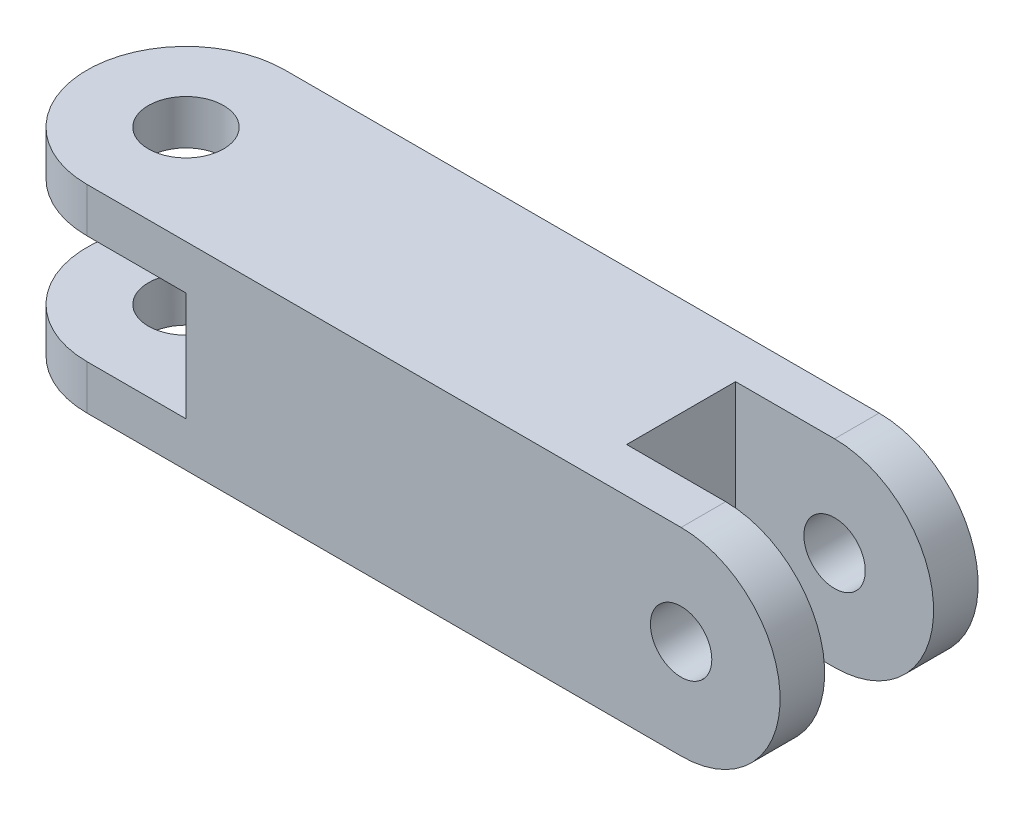
ISO-10303-21;
HEADER;
FILE_DESCRIPTION(('STEP AP214'),'2;1');
FILE_NAME('part.step','',(''),(''),'','','');
FILE_SCHEMA(('AUTOMOTIVE_DESIGN { 1 0 10303 214 1 1 1 1 }'));
ENDSEC;
DATA;
#1=APPLICATION_CONTEXT('core data for automotive mechanical design processes');
#2=APPLICATION_PROTOCOL_DEFINITION('international standard','automotive_design',2000,#1);
#3=PRODUCT_CONTEXT('',#1,'mechanical');
#4=PRODUCT('Part','Part','',(#3));
#5=PRODUCT_RELATED_PRODUCT_CATEGORY('part','',(#4));
#6=PRODUCT_DEFINITION_FORMATION('','',#4);
#7=PRODUCT_DEFINITION_CONTEXT('part definition',#1,'design');
#8=PRODUCT_DEFINITION('design','',#6,#7);
#9=PRODUCT_DEFINITION_SHAPE('','',#8);
#10=(LENGTH_UNIT() NAMED_UNIT(*) SI_UNIT(.MILLI.,.METRE.));
#11=(NAMED_UNIT(*) PLANE_ANGLE_UNIT() SI_UNIT($,.RADIAN.));
#12=(NAMED_UNIT(*) SI_UNIT($,.STERADIAN.) SOLID_ANGLE_UNIT());
#13=UNCERTAINTY_MEASURE_WITH_UNIT(LENGTH_MEASURE(1.E-05),#10,'distance_accuracy_value','');
#14=(GEOMETRIC_REPRESENTATION_CONTEXT(3) GLOBAL_UNCERTAINTY_ASSIGNED_CONTEXT((#13)) GLOBAL_UNIT_ASSIGNED_CONTEXT((#10,
#11,#12)) REPRESENTATION_CONTEXT('',''));
#15=CARTESIAN_POINT('',(0.,0.,0.));
#16=DIRECTION('',(0.,0.,1.));
#17=DIRECTION('',(1.,0.,0.));
#18=AXIS2_PLACEMENT_3D('',#15,#16,#17);
#19=CARTESIAN_POINT('',(-24.0583941605839,-9.11131386861314,5.));
#20=DIRECTION('',(0.,1.,0.));
#21=DIRECTION('',(0.,0.,1.));
#22=AXIS2_PLACEMENT_3D('',#19,#20,#21);
#23=CYLINDRICAL_SURFACE('',#22,1.9);
#24=CARTESIAN_POINT('',(-24.0583941605839,4.13868613138686,5.));
#25=DIRECTION('',(0.,1.,0.));
#26=DIRECTION('',(0.,0.,1.));
#27=AXIS2_PLACEMENT_3D('',#24,#25,#26);
#28=CIRCLE('',#27,1.9);
#29=CARTESIAN_POINT('',(-24.0583941605839,4.13868613138686,6.9));
#30=VERTEX_POINT('',#29);
#31=EDGE_CURVE('E247',#30,#30,#28,.T.);
#32=ORIENTED_EDGE('',*,*,#31,.T.);
#33=EDGE_LOOP('',(#32));
#34=FACE_BOUND('',#33,.T.);
#35=CARTESIAN_POINT('',(-24.0583941605839,1.88868613138686,5.));
#36=DIRECTION('',(0.,1.,0.));
#37=DIRECTION('',(0.,0.,1.));
#38=AXIS2_PLACEMENT_3D('',#35,#36,#37);
#39=CIRCLE('',#38,1.9);
#40=CARTESIAN_POINT('',(-24.0583941605839,1.88868613138686,6.9));
#41=VERTEX_POINT('',#40);
#42=EDGE_CURVE('E292',#41,#41,#39,.T.);
#43=ORIENTED_EDGE('',*,*,#42,.F.);
#44=EDGE_LOOP('',(#43));
#45=FACE_BOUND('',#44,.T.);
#46=ADVANCED_FACE('F32',(#34,#45),#23,.F.);
#47=CARTESIAN_POINT('',(5.94160583941606,-0.861313868613138,13.25));
#48=DIRECTION('',(0.,0.,-1.));
#49=DIRECTION('',(-1.,0.,0.));
#50=AXIS2_PLACEMENT_3D('',#47,#48,#49);
#51=CYLINDRICAL_SURFACE('',#50,1.55);
#52=CARTESIAN_POINT('',(5.94160583941606,-0.861313868613138,10.));
#53=DIRECTION('',(0.,0.,1.));
#54=DIRECTION('',(1.,0.,0.));
#55=AXIS2_PLACEMENT_3D('',#52,#53,#54);
#56=CIRCLE('',#55,1.55);
#57=CARTESIAN_POINT('',(7.49160583941606,-0.861313868613138,10.));
#58=VERTEX_POINT('',#57);
#59=EDGE_CURVE('E288',#58,#58,#56,.T.);
#60=ORIENTED_EDGE('',*,*,#59,.T.);
#61=EDGE_LOOP('',(#60));
#62=FACE_BOUND('',#61,.T.);
#63=CARTESIAN_POINT('',(5.94160583941606,-0.861313868613138,7.75));
#64=DIRECTION('',(0.,0.,1.));
#65=DIRECTION('',(1.,0.,0.));
#66=AXIS2_PLACEMENT_3D('',#63,#64,#65);
#67=CIRCLE('',#66,1.55);
#68=CARTESIAN_POINT('',(7.49160583941606,-0.861313868613138,7.75));
#69=VERTEX_POINT('',#68);
#70=EDGE_CURVE('E285',#69,#69,#67,.T.);
#71=ORIENTED_EDGE('',*,*,#70,.F.);
#72=EDGE_LOOP('',(#71));
#73=FACE_BOUND('',#72,.T.);
#74=ADVANCED_FACE('F190',(#62,#73),#51,.F.);
#75=CARTESIAN_POINT('',(-24.0583941605839,-5.86131386861314,10.));
#76=DIRECTION('',(0.,1.,0.));
#77=DIRECTION('',(0.,0.,1.));
#78=AXIS2_PLACEMENT_3D('',#75,#76,#77);
#79=PLANE('',#78);
#80=CARTESIAN_POINT('',(-24.0583941605839,-5.86131386861314,5.));
#81=DIRECTION('',(0.,1.,0.));
#82=DIRECTION('',(0.,0.,1.));
#83=AXIS2_PLACEMENT_3D('',#80,#81,#82);
#84=CIRCLE('',#83,1.9);
#85=CARTESIAN_POINT('',(-24.0583941605839,-5.86131386861314,6.9));
#86=VERTEX_POINT('',#85);
#87=EDGE_CURVE('E295',#86,#86,#84,.T.);
#88=ORIENTED_EDGE('',*,*,#87,.T.);
#89=EDGE_LOOP('',(#88));
#90=FACE_BOUND('',#89,.T.);
#91=DIRECTION('',(0.,0.,1.));
#92=VECTOR('',#91,1.);
#93=CARTESIAN_POINT('',(0.941605839416056,-5.86131386861314,10.));
#94=LINE('',#93,#92);
#95=CARTESIAN_POINT('',(0.941605839416057,-5.86131386861314,2.25));
#96=VERTEX_POINT('',#95);
#97=CARTESIAN_POINT('',(0.941605839416058,-5.86131386861314,7.75));
#98=VERTEX_POINT('',#97);
#99=EDGE_CURVE('E281',#96,#98,#94,.T.);
#100=ORIENTED_EDGE('',*,*,#99,.T.);
#101=DIRECTION('',(1.,0.,0.));
#102=VECTOR('',#101,1.);
#103=CARTESIAN_POINT('',(-24.0583941605839,-5.86131386861314,7.75000000000001));
#104=LINE('',#103,#102);
#105=CARTESIAN_POINT('',(5.94160583941606,-5.86131386861314,7.75));
#106=VERTEX_POINT('',#105);
#107=EDGE_CURVE('E263',#98,#106,#104,.T.);
#108=ORIENTED_EDGE('',*,*,#107,.T.);
#109=DIRECTION('',(0.,0.,-1.));
#110=VECTOR('',#109,1.);
#111=CARTESIAN_POINT('',(5.94160583941606,-5.86131386861314,10.));
#112=LINE('',#111,#110);
#113=CARTESIAN_POINT('',(5.94160583941606,-5.86131386861314,10.));
#114=VERTEX_POINT('',#113);
#115=EDGE_CURVE('E174',#114,#106,#112,.T.);
#116=ORIENTED_EDGE('',*,*,#115,.F.);
#117=DIRECTION('',(1.,0.,0.));
#118=VECTOR('',#117,1.);
#119=CARTESIAN_POINT('',(-24.0583941605839,-5.86131386861314,10.));
#120=LINE('',#119,#118);
#121=CARTESIAN_POINT('',(-24.0583941605839,-5.86131386861314,10.));
#122=VERTEX_POINT('',#121);
#123=EDGE_CURVE('E158',#122,#114,#120,.T.);
#124=ORIENTED_EDGE('',*,*,#123,.F.);
#125=CARTESIAN_POINT('',(-24.0583941605839,-5.86131386861314,5.));
#126=DIRECTION('',(0.,1.,0.));
#127=DIRECTION('',(0.,0.,1.));
#128=AXIS2_PLACEMENT_3D('',#125,#126,#127);
#129=CIRCLE('',#128,5.);
#130=CARTESIAN_POINT('',(-24.0583941605839,-5.86131386861314,0.));
#131=VERTEX_POINT('',#130);
#132=EDGE_CURVE('E48',#131,#122,#129,.T.);
#133=ORIENTED_EDGE('',*,*,#132,.F.);
#134=DIRECTION('',(1.,0.,0.));
#135=VECTOR('',#134,1.);
#136=CARTESIAN_POINT('',(-24.0583941605839,-5.86131386861314,0.));
#137=LINE('',#136,#135);
#138=CARTESIAN_POINT('',(5.94160583941606,-5.86131386861314,0.));
#139=VERTEX_POINT('',#138);
#140=EDGE_CURVE('E163',#131,#139,#137,.T.);
#141=ORIENTED_EDGE('',*,*,#140,.T.);
#142=DIRECTION('',(0.,0.,-1.));
#143=VECTOR('',#142,1.);
#144=CARTESIAN_POINT('',(5.94160583941606,-5.86131386861314,2.25));
#145=LINE('',#144,#143);
#146=CARTESIAN_POINT('',(5.94160583941606,-5.86131386861314,2.25));
#147=VERTEX_POINT('',#146);
#148=EDGE_CURVE('E252',#139,#147,#145,.F.);
#149=ORIENTED_EDGE('',*,*,#148,.T.);
#150=DIRECTION('',(-1.,0.,0.));
#151=VECTOR('',#150,1.);
#152=CARTESIAN_POINT('',(-24.0583941605839,-5.86131386861314,2.25));
#153=LINE('',#152,#151);
#154=EDGE_CURVE('E276',#147,#96,#153,.T.);
#155=ORIENTED_EDGE('',*,*,#154,.T.);
#156=EDGE_LOOP('',(#100,#108,#116,#124,#133,#141,#149,#155));
#157=FACE_BOUND('',#156,.T.);
#158=ADVANCED_FACE('F34',(#90,#157),#79,.F.);
#159=CARTESIAN_POINT('',(-24.0583941605839,4.13868613138686,10.));
#160=DIRECTION('',(0.,-1.,0.));
#161=DIRECTION('',(0.,0.,-1.));
#162=AXIS2_PLACEMENT_3D('',#159,#160,#161);
#163=PLANE('',#162);
#164=ORIENTED_EDGE('',*,*,#31,.F.);
#165=EDGE_LOOP('',(#164));
#166=FACE_BOUND('',#165,.T.);
#167=DIRECTION('',(0.,0.,-1.));
#168=VECTOR('',#167,1.);
#169=CARTESIAN_POINT('',(5.94160583941606,4.13868613138686,10.));
#170=LINE('',#169,#168);
#171=CARTESIAN_POINT('',(5.94160583941606,4.13868613138686,10.));
#172=VERTEX_POINT('',#171);
#173=CARTESIAN_POINT('',(5.94160583941606,4.13868613138686,7.75));
#174=VERTEX_POINT('',#173);
#175=EDGE_CURVE('E73',#172,#174,#170,.T.);
#176=ORIENTED_EDGE('',*,*,#175,.T.);
#177=DIRECTION('',(1.,0.,0.));
#178=VECTOR('',#177,1.);
#179=CARTESIAN_POINT('',(5.94160583941606,4.13868613138686,7.75));
#180=LINE('',#179,#178);
#181=CARTESIAN_POINT('',(0.941605839416058,4.13868613138686,7.75));
#182=VERTEX_POINT('',#181);
#183=EDGE_CURVE('E250',#182,#174,#180,.T.);
#184=ORIENTED_EDGE('',*,*,#183,.F.);
#185=DIRECTION('',(0.,0.,1.));
#186=VECTOR('',#185,1.);
#187=CARTESIAN_POINT('',(0.941605839416057,4.13868613138686,2.25));
#188=LINE('',#187,#186);
#189=CARTESIAN_POINT('',(0.941605839416057,4.13868613138686,2.25));
#190=VERTEX_POINT('',#189);
#191=EDGE_CURVE('E269',#190,#182,#188,.T.);
#192=ORIENTED_EDGE('',*,*,#191,.F.);
#193=DIRECTION('',(-1.,0.,0.));
#194=VECTOR('',#193,1.);
#195=CARTESIAN_POINT('',(5.94160583941606,4.13868613138686,2.25));
#196=LINE('',#195,#194);
#197=CARTESIAN_POINT('',(5.94160583941606,4.13868613138686,2.25));
#198=VERTEX_POINT('',#197);
#199=EDGE_CURVE('E272',#198,#190,#196,.T.);
#200=ORIENTED_EDGE('',*,*,#199,.F.);
#201=DIRECTION('',(0.,0.,-1.));
#202=VECTOR('',#201,1.);
#203=CARTESIAN_POINT('',(5.94160583941606,4.13868613138686,2.25));
#204=LINE('',#203,#202);
#205=CARTESIAN_POINT('',(5.94160583941606,4.13868613138686,0.));
#206=VERTEX_POINT('',#205);
#207=EDGE_CURVE('E255',#206,#198,#204,.F.);
#208=ORIENTED_EDGE('',*,*,#207,.F.);
#209=DIRECTION('',(-1.,0.,0.));
#210=VECTOR('',#209,1.);
#211=CARTESIAN_POINT('',(-24.0583941605839,4.13868613138686,0.));
#212=LINE('',#211,#210);
#213=CARTESIAN_POINT('',(-24.0583941605839,4.13868613138686,0.));
#214=VERTEX_POINT('',#213);
#215=EDGE_CURVE('E159',#206,#214,#212,.T.);
#216=ORIENTED_EDGE('',*,*,#215,.T.);
#217=CARTESIAN_POINT('',(-24.0583941605839,4.13868613138686,5.));
#218=DIRECTION('',(0.,1.,0.));
#219=DIRECTION('',(0.,0.,1.));
#220=AXIS2_PLACEMENT_3D('',#217,#218,#219);
#221=CIRCLE('',#220,5.);
#222=CARTESIAN_POINT('',(-24.0583941605839,4.13868613138686,10.));
#223=VERTEX_POINT('',#222);
#224=EDGE_CURVE('E152',#214,#223,#221,.T.);
#225=ORIENTED_EDGE('',*,*,#224,.T.);
#226=DIRECTION('',(-1.,0.,0.));
#227=VECTOR('',#226,1.);
#228=CARTESIAN_POINT('',(-24.0583941605839,4.13868613138686,10.));
#229=LINE('',#228,#227);
#230=EDGE_CURVE('E157',#172,#223,#229,.T.);
#231=ORIENTED_EDGE('',*,*,#230,.F.);
#232=EDGE_LOOP('',(#176,#184,#192,#200,#208,#216,#225,#231));
#233=FACE_BOUND('',#232,.T.);
#234=ADVANCED_FACE('F236',(#166,#233),#163,.F.);
#235=CARTESIAN_POINT('',(0.,0.,10.));
#236=DIRECTION('',(0.,0.,1.));
#237=DIRECTION('',(1.,0.,0.));
#238=AXIS2_PLACEMENT_3D('',#235,#236,#237);
#239=PLANE('',#238);
#240=DIRECTION('',(-1.,0.,0.));
#241=VECTOR('',#240,1.);
#242=CARTESIAN_POINT('',(-19.0583941605839,1.88868613138686,10.));
#243=LINE('',#242,#241);
#244=CARTESIAN_POINT('',(-19.0583941605839,1.88868613138686,10.));
#245=VERTEX_POINT('',#244);
#246=CARTESIAN_POINT('',(-24.0583941605839,1.88868613138686,10.));
#247=VERTEX_POINT('',#246);
#248=EDGE_CURVE('E131',#245,#247,#243,.T.);
#249=ORIENTED_EDGE('',*,*,#248,.F.);
#250=DIRECTION('',(0.,1.,0.));
#251=VECTOR('',#250,1.);
#252=CARTESIAN_POINT('',(-19.0583941605839,-3.61131386861314,10.));
#253=LINE('',#252,#251);
#254=CARTESIAN_POINT('',(-19.0583941605839,-3.61131386861314,10.));
#255=VERTEX_POINT('',#254);
#256=EDGE_CURVE('E323',#255,#245,#253,.T.);
#257=ORIENTED_EDGE('',*,*,#256,.F.);
#258=DIRECTION('',(1.,0.,0.));
#259=VECTOR('',#258,1.);
#260=CARTESIAN_POINT('',(-24.0583941605839,-3.61131386861314,10.));
#261=LINE('',#260,#259);
#262=CARTESIAN_POINT('',(-24.0583941605839,-3.61131386861314,10.));
#263=VERTEX_POINT('',#262);
#264=EDGE_CURVE('E143',#263,#255,#261,.T.);
#265=ORIENTED_EDGE('',*,*,#264,.F.);
#266=DIRECTION('',(0.,-1.,0.));
#267=VECTOR('',#266,1.);
#268=CARTESIAN_POINT('',(-24.0583941605839,-3.61131386861314,10.));
#269=LINE('',#268,#267);
#270=EDGE_CURVE('E260',#263,#122,#269,.T.);
#271=ORIENTED_EDGE('',*,*,#270,.T.);
#272=ORIENTED_EDGE('',*,*,#123,.T.);
#273=CARTESIAN_POINT('',(5.94160583941606,-0.861313868613138,10.));
#274=DIRECTION('',(0.,0.,1.));
#275=DIRECTION('',(1.,0.,0.));
#276=AXIS2_PLACEMENT_3D('',#273,#274,#275);
#277=CIRCLE('',#276,5.);
#278=EDGE_CURVE('E68',#114,#172,#277,.T.);
#279=ORIENTED_EDGE('',*,*,#278,.T.);
#280=ORIENTED_EDGE('',*,*,#230,.T.);
#281=DIRECTION('',(0.,-1.,0.));
#282=VECTOR('',#281,1.);
#283=CARTESIAN_POINT('',(-24.0583941605839,4.13868613138686,10.));
#284=LINE('',#283,#282);
#285=EDGE_CURVE('E148',#223,#247,#284,.T.);
#286=ORIENTED_EDGE('',*,*,#285,.T.);
#287=EDGE_LOOP('',(#249,#257,#265,#271,#272,#279,#280,#286));
#288=FACE_BOUND('',#287,.T.);
#289=ORIENTED_EDGE('',*,*,#59,.F.);
#290=EDGE_LOOP('',(#289));
#291=FACE_BOUND('',#290,.T.);
#292=ADVANCED_FACE('F154',(#288,#291),#239,.T.);
#293=CARTESIAN_POINT('',(0.,0.,0.));
#294=DIRECTION('',(0.,0.,1.));
#295=DIRECTION('',(1.,0.,0.));
#296=AXIS2_PLACEMENT_3D('',#293,#294,#295);
#297=PLANE('',#296);
#298=CARTESIAN_POINT('',(5.94160583941606,-0.861313868613138,0.));
#299=DIRECTION('',(0.,0.,-1.));
#300=DIRECTION('',(-1.,0.,0.));
#301=AXIS2_PLACEMENT_3D('',#298,#299,#300);
#302=CIRCLE('',#301,1.55);
#303=CARTESIAN_POINT('',(4.39160583941606,-0.861313868613138,0.));
#304=VERTEX_POINT('',#303);
#305=EDGE_CURVE('E283',#304,#304,#302,.T.);
#306=ORIENTED_EDGE('',*,*,#305,.F.);
#307=EDGE_LOOP('',(#306));
#308=FACE_BOUND('',#307,.T.);
#309=DIRECTION('',(0.,1.,0.));
#310=VECTOR('',#309,1.);
#311=CARTESIAN_POINT('',(-19.0583941605839,0.,0.));
#312=LINE('',#311,#310);
#313=CARTESIAN_POINT('',(-19.0583941605839,-3.61131386861314,0.));
#314=VERTEX_POINT('',#313);
#315=CARTESIAN_POINT('',(-19.0583941605839,1.88868613138686,0.));
#316=VERTEX_POINT('',#315);
#317=EDGE_CURVE('E11',#314,#316,#312,.T.);
#318=ORIENTED_EDGE('',*,*,#317,.T.);
#319=DIRECTION('',(-1.,0.,0.));
#320=VECTOR('',#319,1.);
#321=CARTESIAN_POINT('',(0.,1.88868613138687,0.));
#322=LINE('',#321,#320);
#323=CARTESIAN_POINT('',(-24.0583941605839,1.88868613138686,0.));
#324=VERTEX_POINT('',#323);
#325=EDGE_CURVE('E315',#316,#324,#322,.T.);
#326=ORIENTED_EDGE('',*,*,#325,.T.);
#327=DIRECTION('',(0.,-1.,0.));
#328=VECTOR('',#327,1.);
#329=CARTESIAN_POINT('',(-24.0583941605839,4.13868613138686,0.));
#330=LINE('',#329,#328);
#331=EDGE_CURVE('E151',#214,#324,#330,.T.);
#332=ORIENTED_EDGE('',*,*,#331,.F.);
#333=ORIENTED_EDGE('',*,*,#215,.F.);
#334=CARTESIAN_POINT('',(5.94160583941606,-0.861313868613138,0.));
#335=DIRECTION('',(0.,0.,1.));
#336=DIRECTION('',(1.,0.,0.));
#337=AXIS2_PLACEMENT_3D('',#334,#335,#336);
#338=CIRCLE('',#337,5.);
#339=EDGE_CURVE('E60',#139,#206,#338,.T.);
#340=ORIENTED_EDGE('',*,*,#339,.F.);
#341=ORIENTED_EDGE('',*,*,#140,.F.);
#342=DIRECTION('',(0.,-1.,0.));
#343=VECTOR('',#342,1.);
#344=CARTESIAN_POINT('',(-24.0583941605839,-3.61131386861314,0.));
#345=LINE('',#344,#343);
#346=CARTESIAN_POINT('',(-24.0583941605839,-3.61131386861314,0.));
#347=VERTEX_POINT('',#346);
#348=EDGE_CURVE('E298',#347,#131,#345,.T.);
#349=ORIENTED_EDGE('',*,*,#348,.F.);
#350=DIRECTION('',(1.,0.,0.));
#351=VECTOR('',#350,1.);
#352=CARTESIAN_POINT('',(0.,-3.61131386861314,0.));
#353=LINE('',#352,#351);
#354=EDGE_CURVE('E317',#347,#314,#353,.T.);
#355=ORIENTED_EDGE('',*,*,#354,.T.);
#356=EDGE_LOOP('',(#318,#326,#332,#333,#340,#341,#349,#355));
#357=FACE_BOUND('',#356,.T.);
#358=ADVANCED_FACE('F230',(#308,#357),#297,.F.);
#359=CARTESIAN_POINT('',(5.94160583941606,-0.861313868613138,7.75));
#360=DIRECTION('',(0.,0.,1.));
#361=DIRECTION('',(1.,0.,0.));
#362=AXIS2_PLACEMENT_3D('',#359,#360,#361);
#363=PLANE('',#362);
#364=ORIENTED_EDGE('',*,*,#70,.T.);
#365=EDGE_LOOP('',(#364));
#366=FACE_BOUND('',#365,.T.);
#367=CARTESIAN_POINT('',(5.94160583941606,-0.861313868613138,7.75));
#368=DIRECTION('',(0.,0.,1.));
#369=DIRECTION('',(1.,0.,0.));
#370=AXIS2_PLACEMENT_3D('',#367,#368,#369);
#371=CIRCLE('',#370,5.);
#372=EDGE_CURVE('E170',#106,#174,#371,.T.);
#373=ORIENTED_EDGE('',*,*,#372,.F.);
#374=ORIENTED_EDGE('',*,*,#107,.F.);
#375=DIRECTION('',(0.,1.,0.));
#376=VECTOR('',#375,1.);
#377=CARTESIAN_POINT('',(0.941605839416058,-9.11131386861314,7.75));
#378=LINE('',#377,#376);
#379=EDGE_CURVE('E266',#98,#182,#378,.T.);
#380=ORIENTED_EDGE('',*,*,#379,.T.);
#381=ORIENTED_EDGE('',*,*,#183,.T.);
#382=EDGE_LOOP('',(#373,#374,#380,#381));
#383=FACE_BOUND('',#382,.T.);
#384=ADVANCED_FACE('F227',(#366,#383),#363,.F.);
#385=CARTESIAN_POINT('',(5.94160583941606,-0.861313868613138,7.75));
#386=DIRECTION('',(0.,0.,1.));
#387=DIRECTION('',(1.,0.,0.));
#388=AXIS2_PLACEMENT_3D('',#385,#386,#387);
#389=CYLINDRICAL_SURFACE('',#388,5.);
#390=ORIENTED_EDGE('',*,*,#115,.T.);
#391=ORIENTED_EDGE('',*,*,#372,.T.);
#392=ORIENTED_EDGE('',*,*,#175,.F.);
#393=ORIENTED_EDGE('',*,*,#278,.F.);
#394=EDGE_LOOP('',(#390,#391,#392,#393));
#395=FACE_BOUND('',#394,.T.);
#396=ADVANCED_FACE('F226',(#395),#389,.T.);
#397=CARTESIAN_POINT('',(-24.0583941605839,1.88868613138686,5.));
#398=DIRECTION('',(0.,1.,0.));
#399=DIRECTION('',(0.,0.,1.));
#400=AXIS2_PLACEMENT_3D('',#397,#398,#399);
#401=CYLINDRICAL_SURFACE('',#400,5.);
#402=CARTESIAN_POINT('',(-24.0583941605839,1.88868613138686,5.));
#403=DIRECTION('',(0.,1.,0.));
#404=DIRECTION('',(0.,0.,1.));
#405=AXIS2_PLACEMENT_3D('',#402,#403,#404);
#406=CIRCLE('',#405,5.);
#407=EDGE_CURVE('E135',#324,#247,#406,.T.);
#408=ORIENTED_EDGE('',*,*,#407,.T.);
#409=ORIENTED_EDGE('',*,*,#285,.F.);
#410=ORIENTED_EDGE('',*,*,#224,.F.);
#411=ORIENTED_EDGE('',*,*,#331,.T.);
#412=EDGE_LOOP('',(#408,#409,#410,#411));
#413=FACE_BOUND('',#412,.T.);
#414=ADVANCED_FACE('F147',(#413),#401,.T.);
#415=CARTESIAN_POINT('',(-24.0583941605839,1.88868613138686,5.));
#416=DIRECTION('',(0.,1.,0.));
#417=DIRECTION('',(0.,0.,1.));
#418=AXIS2_PLACEMENT_3D('',#415,#416,#417);
#419=PLANE('',#418);
#420=ORIENTED_EDGE('',*,*,#407,.F.);
#421=ORIENTED_EDGE('',*,*,#325,.F.);
#422=DIRECTION('',(0.,0.,1.));
#423=VECTOR('',#422,1.);
#424=CARTESIAN_POINT('',(-19.0583941605839,1.88868613138686,-3.25));
#425=LINE('',#424,#423);
#426=EDGE_CURVE('E138',#316,#245,#425,.T.);
#427=ORIENTED_EDGE('',*,*,#426,.T.);
#428=ORIENTED_EDGE('',*,*,#248,.T.);
#429=EDGE_LOOP('',(#420,#421,#427,#428));
#430=FACE_BOUND('',#429,.T.);
#431=ORIENTED_EDGE('',*,*,#42,.T.);
#432=EDGE_LOOP('',(#431));
#433=FACE_BOUND('',#432,.T.);
#434=ADVANCED_FACE('F133',(#430,#433),#419,.F.);
#435=CARTESIAN_POINT('',(5.94160583941606,-0.861313868613138,2.25));
#436=DIRECTION('',(0.,0.,-1.));
#437=DIRECTION('',(1.,0.,0.));
#438=AXIS2_PLACEMENT_3D('',#435,#436,#437);
#439=PLANE('',#438);
#440=CARTESIAN_POINT('',(5.94160583941606,-0.861313868613138,2.25));
#441=DIRECTION('',(0.,0.,-1.));
#442=DIRECTION('',(-1.,0.,0.));
#443=AXIS2_PLACEMENT_3D('',#440,#441,#442);
#444=CIRCLE('',#443,1.55);
#445=CARTESIAN_POINT('',(4.39160583941606,-0.861313868613138,2.25));
#446=VERTEX_POINT('',#445);
#447=EDGE_CURVE('E41',#446,#446,#444,.T.);
#448=ORIENTED_EDGE('',*,*,#447,.T.);
#449=EDGE_LOOP('',(#448));
#450=FACE_BOUND('',#449,.T.);
#451=CARTESIAN_POINT('',(5.94160583941606,-0.861313868613138,2.25));
#452=DIRECTION('',(0.,0.,1.));
#453=DIRECTION('',(1.,0.,0.));
#454=AXIS2_PLACEMENT_3D('',#451,#452,#453);
#455=CIRCLE('',#454,5.);
#456=EDGE_CURVE('E305',#147,#198,#455,.T.);
#457=ORIENTED_EDGE('',*,*,#456,.T.);
#458=ORIENTED_EDGE('',*,*,#199,.T.);
#459=DIRECTION('',(0.,1.,0.));
#460=VECTOR('',#459,1.);
#461=CARTESIAN_POINT('',(0.941605839416057,-9.11131386861314,2.25));
#462=LINE('',#461,#460);
#463=EDGE_CURVE('E268',#96,#190,#462,.T.);
#464=ORIENTED_EDGE('',*,*,#463,.F.);
#465=ORIENTED_EDGE('',*,*,#154,.F.);
#466=EDGE_LOOP('',(#457,#458,#464,#465));
#467=FACE_BOUND('',#466,.T.);
#468=ADVANCED_FACE('F181',(#450,#467),#439,.F.);
#469=CARTESIAN_POINT('',(5.94160583941606,-0.861313868613138,2.25));
#470=DIRECTION('',(0.,0.,-1.));
#471=DIRECTION('',(-1.,0.,0.));
#472=AXIS2_PLACEMENT_3D('',#469,#470,#471);
#473=CYLINDRICAL_SURFACE('',#472,5.);
#474=ORIENTED_EDGE('',*,*,#148,.F.);
#475=ORIENTED_EDGE('',*,*,#339,.T.);
#476=ORIENTED_EDGE('',*,*,#207,.T.);
#477=ORIENTED_EDGE('',*,*,#456,.F.);
#478=EDGE_LOOP('',(#474,#475,#476,#477));
#479=FACE_BOUND('',#478,.T.);
#480=ADVANCED_FACE('F217',(#479),#473,.T.);
#481=CARTESIAN_POINT('',(-24.0583941605839,-3.61131386861314,5.));
#482=DIRECTION('',(0.,-1.,0.));
#483=DIRECTION('',(0.,0.,-1.));
#484=AXIS2_PLACEMENT_3D('',#481,#482,#483);
#485=CYLINDRICAL_SURFACE('',#484,5.);
#486=ORIENTED_EDGE('',*,*,#132,.T.);
#487=ORIENTED_EDGE('',*,*,#270,.F.);
#488=CARTESIAN_POINT('',(-24.0583941605839,-3.61131386861314,5.));
#489=DIRECTION('',(0.,1.,0.));
#490=DIRECTION('',(0.,0.,1.));
#491=AXIS2_PLACEMENT_3D('',#488,#489,#490);
#492=CIRCLE('',#491,5.);
#493=EDGE_CURVE('E300',#347,#263,#492,.T.);
#494=ORIENTED_EDGE('',*,*,#493,.F.);
#495=ORIENTED_EDGE('',*,*,#348,.T.);
#496=EDGE_LOOP('',(#486,#487,#494,#495));
#497=FACE_BOUND('',#496,.T.);
#498=ADVANCED_FACE('F213',(#497),#485,.T.);
#499=CARTESIAN_POINT('',(-24.0583941605839,-3.61131386861314,5.));
#500=DIRECTION('',(0.,-1.,0.));
#501=DIRECTION('',(0.,0.,1.));
#502=AXIS2_PLACEMENT_3D('',#499,#500,#501);
#503=PLANE('',#502);
#504=CARTESIAN_POINT('',(-24.0583941605839,-3.61131386861314,5.));
#505=DIRECTION('',(0.,-1.,0.));
#506=DIRECTION('',(0.,0.,-1.));
#507=AXIS2_PLACEMENT_3D('',#504,#505,#506);
#508=CIRCLE('',#507,1.9);
#509=CARTESIAN_POINT('',(-24.0583941605839,-3.61131386861314,3.1));
#510=VERTEX_POINT('',#509);
#511=EDGE_CURVE('E176',#510,#510,#508,.T.);
#512=ORIENTED_EDGE('',*,*,#511,.T.);
#513=EDGE_LOOP('',(#512));
#514=FACE_BOUND('',#513,.T.);
#515=ORIENTED_EDGE('',*,*,#493,.T.);
#516=ORIENTED_EDGE('',*,*,#264,.T.);
#517=DIRECTION('',(0.,0.,1.));
#518=VECTOR('',#517,1.);
#519=CARTESIAN_POINT('',(-19.0583941605839,-3.61131386861314,-3.25));
#520=LINE('',#519,#518);
#521=EDGE_CURVE('E321',#314,#255,#520,.T.);
#522=ORIENTED_EDGE('',*,*,#521,.F.);
#523=ORIENTED_EDGE('',*,*,#354,.F.);
#524=EDGE_LOOP('',(#515,#516,#522,#523));
#525=FACE_BOUND('',#524,.T.);
#526=ADVANCED_FACE('F198',(#514,#525),#503,.F.);
#527=ORIENTED_EDGE('',*,*,#511,.F.);
#528=EDGE_LOOP('',(#527));
#529=FACE_BOUND('',#528,.T.);
#530=ORIENTED_EDGE('',*,*,#87,.F.);
#531=EDGE_LOOP('',(#530));
#532=FACE_BOUND('',#531,.T.);
#533=ADVANCED_FACE('F187',(#529,#532),#23,.F.);
#534=ORIENTED_EDGE('',*,*,#305,.T.);
#535=EDGE_LOOP('',(#534));
#536=FACE_BOUND('',#535,.T.);
#537=ORIENTED_EDGE('',*,*,#447,.F.);
#538=EDGE_LOOP('',(#537));
#539=FACE_BOUND('',#538,.T.);
#540=ADVANCED_FACE('F184',(#536,#539),#51,.F.);
#541=CARTESIAN_POINT('',(0.941605839416057,-9.11131386861314,2.25));
#542=DIRECTION('',(-1.,0.,0.));
#543=DIRECTION('',(0.,0.,1.));
#544=AXIS2_PLACEMENT_3D('',#541,#542,#543);
#545=PLANE('',#544);
#546=ORIENTED_EDGE('',*,*,#463,.T.);
#547=ORIENTED_EDGE('',*,*,#191,.T.);
#548=ORIENTED_EDGE('',*,*,#379,.F.);
#549=ORIENTED_EDGE('',*,*,#99,.F.);
#550=EDGE_LOOP('',(#546,#547,#548,#549));
#551=FACE_BOUND('',#550,.T.);
#552=ADVANCED_FACE('F186',(#551),#545,.F.);
#553=CARTESIAN_POINT('',(-19.0583941605839,-3.61131386861314,-3.25));
#554=DIRECTION('',(1.,0.,0.));
#555=DIRECTION('',(0.,0.,-1.));
#556=AXIS2_PLACEMENT_3D('',#553,#554,#555);
#557=PLANE('',#556);
#558=ORIENTED_EDGE('',*,*,#521,.T.);
#559=ORIENTED_EDGE('',*,*,#256,.T.);
#560=ORIENTED_EDGE('',*,*,#426,.F.);
#561=ORIENTED_EDGE('',*,*,#317,.F.);
#562=EDGE_LOOP('',(#558,#559,#560,#561));
#563=FACE_BOUND('',#562,.T.);
#564=ADVANCED_FACE('F195',(#563),#557,.F.);
#565=CLOSED_SHELL('',(#46,#74,#158,#234,#292,#358,#384,#396,#414,#434,#468,#480,#498,#526,#533,
#540,#552,#564));
#566=MANIFOLD_SOLID_BREP('B2',#565);
#567=ADVANCED_BREP_SHAPE_REPRESENTATION('',(#18,#566),#14);
#568=SHAPE_DEFINITION_REPRESENTATION(#9,#567);
ENDSEC;
END-ISO-10303-21;
